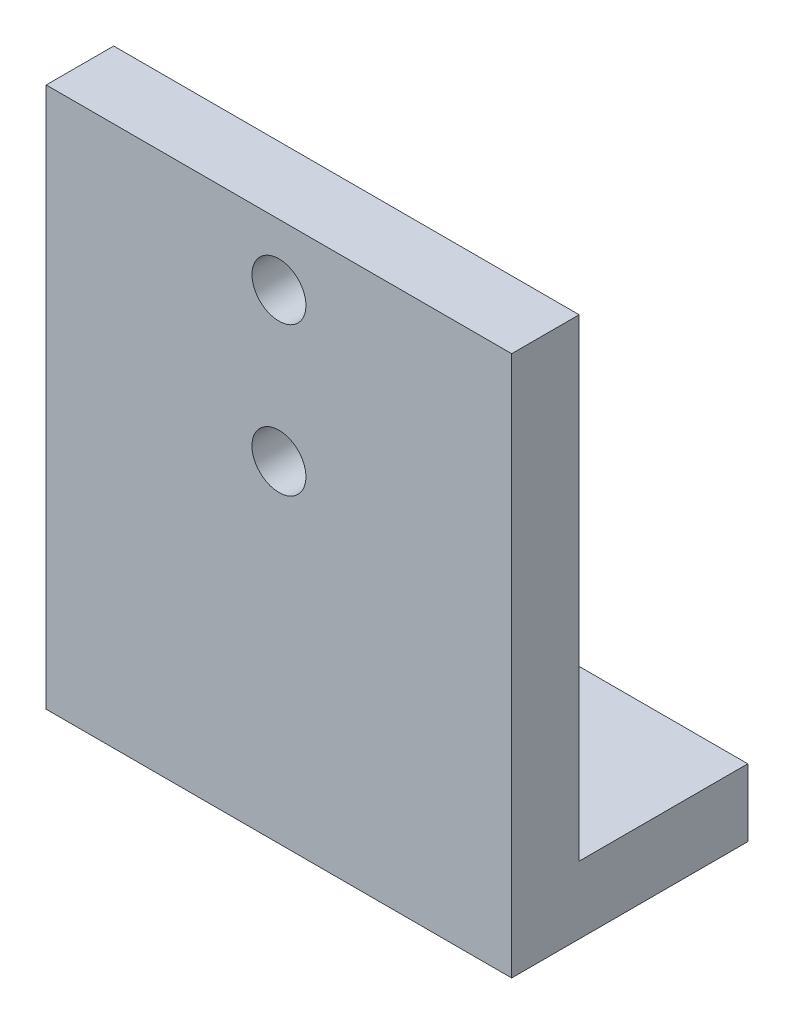
ISO-10303-21;
HEADER;
FILE_DESCRIPTION(('STEP AP214'),'2;1');
FILE_NAME('part.step','',(''),(''),'','','');
FILE_SCHEMA(('AUTOMOTIVE_DESIGN { 1 0 10303 214 1 1 1 1 }'));
ENDSEC;
DATA;
#1=APPLICATION_CONTEXT('core data for automotive mechanical design processes');
#2=APPLICATION_PROTOCOL_DEFINITION('international standard','automotive_design',2000,#1);
#3=PRODUCT_CONTEXT('',#1,'mechanical');
#4=PRODUCT('Part','Part','',(#3));
#5=PRODUCT_RELATED_PRODUCT_CATEGORY('part','',(#4));
#6=PRODUCT_DEFINITION_FORMATION('','',#4);
#7=PRODUCT_DEFINITION_CONTEXT('part definition',#1,'design');
#8=PRODUCT_DEFINITION('design','',#6,#7);
#9=PRODUCT_DEFINITION_SHAPE('','',#8);
#10=(LENGTH_UNIT() NAMED_UNIT(*) SI_UNIT(.MILLI.,.METRE.));
#11=(NAMED_UNIT(*) PLANE_ANGLE_UNIT() SI_UNIT($,.RADIAN.));
#12=(NAMED_UNIT(*) SI_UNIT($,.STERADIAN.) SOLID_ANGLE_UNIT());
#13=UNCERTAINTY_MEASURE_WITH_UNIT(LENGTH_MEASURE(1.E-05),#10,'distance_accuracy_value','');
#14=(GEOMETRIC_REPRESENTATION_CONTEXT(3) GLOBAL_UNCERTAINTY_ASSIGNED_CONTEXT((#13)) GLOBAL_UNIT_ASSIGNED_CONTEXT((#10,
#11,#12)) REPRESENTATION_CONTEXT('',''));
#15=CARTESIAN_POINT('',(0.,0.,0.));
#16=DIRECTION('',(0.,0.,1.));
#17=DIRECTION('',(1.,0.,0.));
#18=AXIS2_PLACEMENT_3D('',#15,#16,#17);
#19=CARTESIAN_POINT('',(69.,80.15,-10.));
#20=DIRECTION('',(0.,-1.,0.));
#21=DIRECTION('',(0.,0.,-1.));
#22=AXIS2_PLACEMENT_3D('',#19,#20,#21);
#23=PLANE('',#22);
#24=DIRECTION('',(0.,0.,1.));
#25=VECTOR('',#24,1.);
#26=CARTESIAN_POINT('',(0.,80.15,-10.));
#27=LINE('',#26,#25);
#28=CARTESIAN_POINT('',(0.,80.15,-10.));
#29=VERTEX_POINT('',#28);
#30=CARTESIAN_POINT('',(0.,80.15,0.));
#31=VERTEX_POINT('',#30);
#32=EDGE_CURVE('E134',#29,#31,#27,.T.);
#33=ORIENTED_EDGE('',*,*,#32,.T.);
#34=DIRECTION('',(-1.,0.,0.));
#35=VECTOR('',#34,1.);
#36=CARTESIAN_POINT('',(69.,80.15,0.));
#37=LINE('',#36,#35);
#38=CARTESIAN_POINT('',(69.,80.15,0.));
#39=VERTEX_POINT('',#38);
#40=EDGE_CURVE('E11',#39,#31,#37,.T.);
#41=ORIENTED_EDGE('',*,*,#40,.F.);
#42=DIRECTION('',(0.,0.,1.));
#43=VECTOR('',#42,1.);
#44=CARTESIAN_POINT('',(69.,80.15,-10.));
#45=LINE('',#44,#43);
#46=CARTESIAN_POINT('',(69.,80.15,-10.));
#47=VERTEX_POINT('',#46);
#48=EDGE_CURVE('E151',#47,#39,#45,.T.);
#49=ORIENTED_EDGE('',*,*,#48,.F.);
#50=DIRECTION('',(-1.,0.,0.));
#51=VECTOR('',#50,1.);
#52=CARTESIAN_POINT('',(69.,80.15,-10.));
#53=LINE('',#52,#51);
#54=EDGE_CURVE('E130',#47,#29,#53,.T.);
#55=ORIENTED_EDGE('',*,*,#54,.T.);
#56=EDGE_LOOP('',(#33,#41,#49,#55));
#57=FACE_BOUND('',#56,.T.);
#58=ADVANCED_FACE('F45',(#57),#23,.F.);
#59=CARTESIAN_POINT('',(69.,80.15,0.));
#60=DIRECTION('',(0.,0.,-1.));
#61=DIRECTION('',(0.,1.,0.));
#62=AXIS2_PLACEMENT_3D('',#59,#60,#61);
#63=PLANE('',#62);
#64=CARTESIAN_POINT('',(34.5,71.08,0.));
#65=DIRECTION('',(0.,0.,-1.));
#66=DIRECTION('',(0.,1.,0.));
#67=AXIS2_PLACEMENT_3D('',#64,#65,#66);
#68=CIRCLE('',#67,4.);
#69=CARTESIAN_POINT('',(34.5,75.08,0.));
#70=VERTEX_POINT('',#69);
#71=EDGE_CURVE('E139',#70,#70,#68,.T.);
#72=ORIENTED_EDGE('',*,*,#71,.T.);
#73=EDGE_LOOP('',(#72));
#74=FACE_BOUND('',#73,.T.);
#75=CARTESIAN_POINT('',(34.5,49.08,0.));
#76=DIRECTION('',(0.,0.,-1.));
#77=DIRECTION('',(0.,1.,0.));
#78=AXIS2_PLACEMENT_3D('',#75,#76,#77);
#79=CIRCLE('',#78,4.);
#80=CARTESIAN_POINT('',(34.5,53.08,0.));
#81=VERTEX_POINT('',#80);
#82=EDGE_CURVE('E268',#81,#81,#79,.T.);
#83=ORIENTED_EDGE('',*,*,#82,.T.);
#84=EDGE_LOOP('',(#83));
#85=FACE_BOUND('',#84,.T.);
#86=DIRECTION('',(0.,-1.,0.));
#87=VECTOR('',#86,1.);
#88=CARTESIAN_POINT('',(0.,80.15,0.));
#89=LINE('',#88,#87);
#90=CARTESIAN_POINT('',(0.,0.,0.));
#91=VERTEX_POINT('',#90);
#92=EDGE_CURVE('E138',#31,#91,#89,.T.);
#93=ORIENTED_EDGE('',*,*,#92,.T.);
#94=DIRECTION('',(-1.,0.,0.));
#95=VECTOR('',#94,1.);
#96=CARTESIAN_POINT('',(69.,0.,0.));
#97=LINE('',#96,#95);
#98=CARTESIAN_POINT('',(69.,0.,0.));
#99=VERTEX_POINT('',#98);
#100=EDGE_CURVE('E54',#99,#91,#97,.T.);
#101=ORIENTED_EDGE('',*,*,#100,.F.);
#102=DIRECTION('',(0.,-1.,0.));
#103=VECTOR('',#102,1.);
#104=CARTESIAN_POINT('',(69.,80.15,0.));
#105=LINE('',#104,#103);
#106=EDGE_CURVE('E99',#39,#99,#105,.T.);
#107=ORIENTED_EDGE('',*,*,#106,.F.);
#108=ORIENTED_EDGE('',*,*,#40,.T.);
#109=EDGE_LOOP('',(#93,#101,#107,#108));
#110=FACE_BOUND('',#109,.T.);
#111=ADVANCED_FACE('F185',(#74,#85,#110),#63,.F.);
#112=CARTESIAN_POINT('',(69.,0.,0.));
#113=DIRECTION('',(0.,1.,0.));
#114=DIRECTION('',(0.,0.,1.));
#115=AXIS2_PLACEMENT_3D('',#112,#113,#114);
#116=PLANE('',#115);
#117=CARTESIAN_POINT('',(17.,0.,-22.5));
#118=DIRECTION('',(0.,1.,0.));
#119=DIRECTION('',(0.,0.,1.));
#120=AXIS2_PLACEMENT_3D('',#117,#118,#119);
#121=CIRCLE('',#120,3.);
#122=CARTESIAN_POINT('',(17.,0.,-19.5));
#123=VERTEX_POINT('',#122);
#124=EDGE_CURVE('E259',#123,#123,#121,.T.);
#125=ORIENTED_EDGE('',*,*,#124,.T.);
#126=EDGE_LOOP('',(#125));
#127=FACE_BOUND('',#126,.T.);
#128=CARTESIAN_POINT('',(52.,0.,-22.5));
#129=DIRECTION('',(0.,1.,0.));
#130=DIRECTION('',(0.,0.,-1.));
#131=AXIS2_PLACEMENT_3D('',#128,#129,#130);
#132=CIRCLE('',#131,3.);
#133=CARTESIAN_POINT('',(52.,0.,-25.5));
#134=VERTEX_POINT('',#133);
#135=EDGE_CURVE('E271',#134,#134,#132,.T.);
#136=ORIENTED_EDGE('',*,*,#135,.T.);
#137=EDGE_LOOP('',(#136));
#138=FACE_BOUND('',#137,.T.);
#139=DIRECTION('',(0.,0.,-1.));
#140=VECTOR('',#139,1.);
#141=CARTESIAN_POINT('',(0.,0.,0.));
#142=LINE('',#141,#140);
#143=CARTESIAN_POINT('',(0.,0.,-35.));
#144=VERTEX_POINT('',#143);
#145=EDGE_CURVE('E142',#91,#144,#142,.T.);
#146=ORIENTED_EDGE('',*,*,#145,.T.);
#147=DIRECTION('',(-1.,0.,0.));
#148=VECTOR('',#147,1.);
#149=CARTESIAN_POINT('',(69.,0.,-35.));
#150=LINE('',#149,#148);
#151=CARTESIAN_POINT('',(69.,0.,-35.));
#152=VERTEX_POINT('',#151);
#153=EDGE_CURVE('E123',#152,#144,#150,.T.);
#154=ORIENTED_EDGE('',*,*,#153,.F.);
#155=DIRECTION('',(0.,0.,-1.));
#156=VECTOR('',#155,1.);
#157=CARTESIAN_POINT('',(69.,0.,0.));
#158=LINE('',#157,#156);
#159=EDGE_CURVE('E112',#99,#152,#158,.T.);
#160=ORIENTED_EDGE('',*,*,#159,.F.);
#161=ORIENTED_EDGE('',*,*,#100,.T.);
#162=EDGE_LOOP('',(#146,#154,#160,#161));
#163=FACE_BOUND('',#162,.T.);
#164=ADVANCED_FACE('F161',(#127,#138,#163),#116,.F.);
#165=CARTESIAN_POINT('',(69.,0.,-35.));
#166=DIRECTION('',(0.,0.,1.));
#167=DIRECTION('',(1.,0.,0.));
#168=AXIS2_PLACEMENT_3D('',#165,#166,#167);
#169=PLANE('',#168);
#170=DIRECTION('',(0.,1.,0.));
#171=VECTOR('',#170,1.);
#172=CARTESIAN_POINT('',(0.,0.,-35.));
#173=LINE('',#172,#171);
#174=CARTESIAN_POINT('',(0.,10.,-35.));
#175=VERTEX_POINT('',#174);
#176=EDGE_CURVE('E121',#144,#175,#173,.T.);
#177=ORIENTED_EDGE('',*,*,#176,.T.);
#178=DIRECTION('',(-1.,0.,0.));
#179=VECTOR('',#178,1.);
#180=CARTESIAN_POINT('',(69.,10.,-35.));
#181=LINE('',#180,#179);
#182=CARTESIAN_POINT('',(69.,10.,-35.));
#183=VERTEX_POINT('',#182);
#184=EDGE_CURVE('E118',#183,#175,#181,.T.);
#185=ORIENTED_EDGE('',*,*,#184,.F.);
#186=DIRECTION('',(0.,1.,0.));
#187=VECTOR('',#186,1.);
#188=CARTESIAN_POINT('',(69.,0.,-35.));
#189=LINE('',#188,#187);
#190=EDGE_CURVE('E106',#152,#183,#189,.T.);
#191=ORIENTED_EDGE('',*,*,#190,.F.);
#192=ORIENTED_EDGE('',*,*,#153,.T.);
#193=EDGE_LOOP('',(#177,#185,#191,#192));
#194=FACE_BOUND('',#193,.T.);
#195=ADVANCED_FACE('F119',(#194),#169,.F.);
#196=CARTESIAN_POINT('',(69.,10.,-35.));
#197=DIRECTION('',(0.,-1.,0.));
#198=DIRECTION('',(0.,0.,-1.));
#199=AXIS2_PLACEMENT_3D('',#196,#197,#198);
#200=PLANE('',#199);
#201=CARTESIAN_POINT('',(17.,10.,-22.5));
#202=DIRECTION('',(0.,1.,0.));
#203=DIRECTION('',(0.,0.,1.));
#204=AXIS2_PLACEMENT_3D('',#201,#202,#203);
#205=CIRCLE('',#204,3.);
#206=CARTESIAN_POINT('',(17.,10.,-19.5));
#207=VERTEX_POINT('',#206);
#208=EDGE_CURVE('E262',#207,#207,#205,.T.);
#209=ORIENTED_EDGE('',*,*,#208,.F.);
#210=EDGE_LOOP('',(#209));
#211=FACE_BOUND('',#210,.T.);
#212=CARTESIAN_POINT('',(52.,10.,-22.5));
#213=DIRECTION('',(0.,1.,0.));
#214=DIRECTION('',(0.,0.,-1.));
#215=AXIS2_PLACEMENT_3D('',#212,#213,#214);
#216=CIRCLE('',#215,3.);
#217=CARTESIAN_POINT('',(52.,10.,-25.5));
#218=VERTEX_POINT('',#217);
#219=EDGE_CURVE('E264',#218,#218,#216,.T.);
#220=ORIENTED_EDGE('',*,*,#219,.F.);
#221=EDGE_LOOP('',(#220));
#222=FACE_BOUND('',#221,.T.);
#223=DIRECTION('',(0.,0.,1.));
#224=VECTOR('',#223,1.);
#225=CARTESIAN_POINT('',(0.,10.,-35.));
#226=LINE('',#225,#224);
#227=CARTESIAN_POINT('',(0.,9.99999999999999,-10.));
#228=VERTEX_POINT('',#227);
#229=EDGE_CURVE('E85',#175,#228,#226,.T.);
#230=ORIENTED_EDGE('',*,*,#229,.T.);
#231=DIRECTION('',(-1.,0.,0.));
#232=VECTOR('',#231,1.);
#233=CARTESIAN_POINT('',(69.,9.99999999999999,-10.));
#234=LINE('',#233,#232);
#235=CARTESIAN_POINT('',(69.,9.99999999999999,-10.));
#236=VERTEX_POINT('',#235);
#237=EDGE_CURVE('E124',#236,#228,#234,.T.);
#238=ORIENTED_EDGE('',*,*,#237,.F.);
#239=DIRECTION('',(0.,0.,1.));
#240=VECTOR('',#239,1.);
#241=CARTESIAN_POINT('',(69.,10.,-35.));
#242=LINE('',#241,#240);
#243=EDGE_CURVE('E110',#183,#236,#242,.T.);
#244=ORIENTED_EDGE('',*,*,#243,.F.);
#245=ORIENTED_EDGE('',*,*,#184,.T.);
#246=EDGE_LOOP('',(#230,#238,#244,#245));
#247=FACE_BOUND('',#246,.T.);
#248=ADVANCED_FACE('F126',(#211,#222,#247),#200,.F.);
#249=CARTESIAN_POINT('',(69.,9.99999999999999,-10.));
#250=DIRECTION('',(0.,0.,1.));
#251=DIRECTION('',(0.,-1.,0.));
#252=AXIS2_PLACEMENT_3D('',#249,#250,#251);
#253=PLANE('',#252);
#254=CARTESIAN_POINT('',(34.5,71.08,-10.));
#255=DIRECTION('',(0.,0.,-1.));
#256=DIRECTION('',(0.,1.,0.));
#257=AXIS2_PLACEMENT_3D('',#254,#255,#256);
#258=CIRCLE('',#257,4.);
#259=CARTESIAN_POINT('',(34.5,75.08,-10.));
#260=VERTEX_POINT('',#259);
#261=EDGE_CURVE('E279',#260,#260,#258,.T.);
#262=ORIENTED_EDGE('',*,*,#261,.F.);
#263=EDGE_LOOP('',(#262));
#264=FACE_BOUND('',#263,.T.);
#265=CARTESIAN_POINT('',(34.5,49.08,-10.));
#266=DIRECTION('',(0.,0.,-1.));
#267=DIRECTION('',(0.,1.,0.));
#268=AXIS2_PLACEMENT_3D('',#265,#266,#267);
#269=CIRCLE('',#268,4.);
#270=CARTESIAN_POINT('',(34.5,53.08,-10.));
#271=VERTEX_POINT('',#270);
#272=EDGE_CURVE('E283',#271,#271,#269,.T.);
#273=ORIENTED_EDGE('',*,*,#272,.F.);
#274=EDGE_LOOP('',(#273));
#275=FACE_BOUND('',#274,.T.);
#276=DIRECTION('',(0.,1.,0.));
#277=VECTOR('',#276,1.);
#278=CARTESIAN_POINT('',(0.,9.99999999999999,-10.));
#279=LINE('',#278,#277);
#280=EDGE_CURVE('E91',#228,#29,#279,.T.);
#281=ORIENTED_EDGE('',*,*,#280,.T.);
#282=ORIENTED_EDGE('',*,*,#54,.F.);
#283=DIRECTION('',(0.,1.,0.));
#284=VECTOR('',#283,1.);
#285=CARTESIAN_POINT('',(69.,9.99999999999999,-10.));
#286=LINE('',#285,#284);
#287=EDGE_CURVE('E62',#236,#47,#286,.T.);
#288=ORIENTED_EDGE('',*,*,#287,.F.);
#289=ORIENTED_EDGE('',*,*,#237,.T.);
#290=EDGE_LOOP('',(#281,#282,#288,#289));
#291=FACE_BOUND('',#290,.T.);
#292=ADVANCED_FACE('F168',(#264,#275,#291),#253,.F.);
#293=CARTESIAN_POINT('',(69.,0.,0.));
#294=DIRECTION('',(1.,0.,0.));
#295=DIRECTION('',(0.,0.,-1.));
#296=AXIS2_PLACEMENT_3D('',#293,#294,#295);
#297=PLANE('',#296);
#298=ORIENTED_EDGE('',*,*,#48,.T.);
#299=ORIENTED_EDGE('',*,*,#106,.T.);
#300=ORIENTED_EDGE('',*,*,#159,.T.);
#301=ORIENTED_EDGE('',*,*,#190,.T.);
#302=ORIENTED_EDGE('',*,*,#243,.T.);
#303=ORIENTED_EDGE('',*,*,#287,.T.);
#304=EDGE_LOOP('',(#298,#299,#300,#301,#302,#303));
#305=FACE_BOUND('',#304,.T.);
#306=ADVANCED_FACE('F108',(#305),#297,.T.);
#307=CARTESIAN_POINT('',(0.,0.,0.));
#308=DIRECTION('',(1.,0.,0.));
#309=DIRECTION('',(0.,0.,-1.));
#310=AXIS2_PLACEMENT_3D('',#307,#308,#309);
#311=PLANE('',#310);
#312=ORIENTED_EDGE('',*,*,#32,.F.);
#313=ORIENTED_EDGE('',*,*,#280,.F.);
#314=ORIENTED_EDGE('',*,*,#229,.F.);
#315=ORIENTED_EDGE('',*,*,#176,.F.);
#316=ORIENTED_EDGE('',*,*,#145,.F.);
#317=ORIENTED_EDGE('',*,*,#92,.F.);
#318=EDGE_LOOP('',(#312,#313,#314,#315,#316,#317));
#319=FACE_BOUND('',#318,.T.);
#320=ADVANCED_FACE('F164',(#319),#311,.F.);
#321=CARTESIAN_POINT('',(34.5,49.08,0.));
#322=DIRECTION('',(0.,0.,-1.));
#323=DIRECTION('',(0.,1.,0.));
#324=AXIS2_PLACEMENT_3D('',#321,#322,#323);
#325=CYLINDRICAL_SURFACE('',#324,4.);
#326=ORIENTED_EDGE('',*,*,#82,.F.);
#327=EDGE_LOOP('',(#326));
#328=FACE_BOUND('',#327,.T.);
#329=ORIENTED_EDGE('',*,*,#272,.T.);
#330=EDGE_LOOP('',(#329));
#331=FACE_BOUND('',#330,.T.);
#332=ADVANCED_FACE('F213',(#328,#331),#325,.F.);
#333=CARTESIAN_POINT('',(34.5,71.08,0.));
#334=DIRECTION('',(0.,0.,-1.));
#335=DIRECTION('',(0.,1.,0.));
#336=AXIS2_PLACEMENT_3D('',#333,#334,#335);
#337=CYLINDRICAL_SURFACE('',#336,4.);
#338=ORIENTED_EDGE('',*,*,#71,.F.);
#339=EDGE_LOOP('',(#338));
#340=FACE_BOUND('',#339,.T.);
#341=ORIENTED_EDGE('',*,*,#261,.T.);
#342=EDGE_LOOP('',(#341));
#343=FACE_BOUND('',#342,.T.);
#344=ADVANCED_FACE('F223',(#340,#343),#337,.F.);
#345=CARTESIAN_POINT('',(52.,0.,-22.5));
#346=DIRECTION('',(0.,1.,0.));
#347=DIRECTION('',(0.,0.,1.));
#348=AXIS2_PLACEMENT_3D('',#345,#346,#347);
#349=CYLINDRICAL_SURFACE('',#348,3.);
#350=ORIENTED_EDGE('',*,*,#135,.F.);
#351=EDGE_LOOP('',(#350));
#352=FACE_BOUND('',#351,.T.);
#353=ORIENTED_EDGE('',*,*,#219,.T.);
#354=EDGE_LOOP('',(#353));
#355=FACE_BOUND('',#354,.T.);
#356=ADVANCED_FACE('F233',(#352,#355),#349,.F.);
#357=CARTESIAN_POINT('',(17.,0.,-22.5));
#358=DIRECTION('',(0.,1.,0.));
#359=DIRECTION('',(0.,0.,1.));
#360=AXIS2_PLACEMENT_3D('',#357,#358,#359);
#361=CYLINDRICAL_SURFACE('',#360,3.);
#362=ORIENTED_EDGE('',*,*,#124,.F.);
#363=EDGE_LOOP('',(#362));
#364=FACE_BOUND('',#363,.T.);
#365=ORIENTED_EDGE('',*,*,#208,.T.);
#366=EDGE_LOOP('',(#365));
#367=FACE_BOUND('',#366,.T.);
#368=ADVANCED_FACE('F243',(#364,#367),#361,.F.);
#369=CLOSED_SHELL('',(#58,#111,#164,#195,#248,#292,#306,#320,#332,#344,#356,#368));
#370=MANIFOLD_SOLID_BREP('B2',#369);
#371=ADVANCED_BREP_SHAPE_REPRESENTATION('',(#18,#370),#14);
#372=SHAPE_DEFINITION_REPRESENTATION(#9,#371);
ENDSEC;
END-ISO-10303-21;
